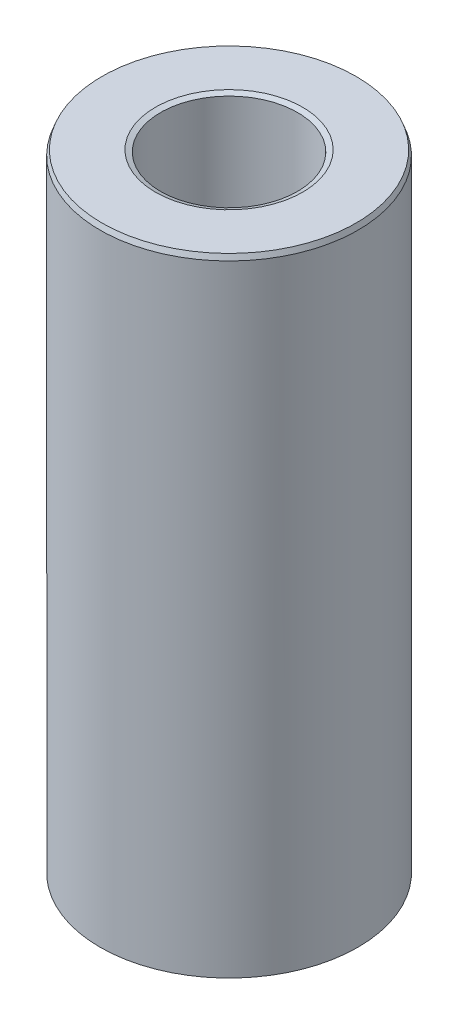
ISO-10303-21;
HEADER;
FILE_DESCRIPTION(('STEP AP214'),'2;1');
FILE_NAME('part.step','',(''),(''),'','','');
FILE_SCHEMA(('AUTOMOTIVE_DESIGN { 1 0 10303 214 1 1 1 1 }'));
ENDSEC;
DATA;
#1=APPLICATION_CONTEXT('core data for automotive mechanical design processes');
#2=APPLICATION_PROTOCOL_DEFINITION('international standard','automotive_design',2000,#1);
#3=PRODUCT_CONTEXT('',#1,'mechanical');
#4=PRODUCT('Part','Part','',(#3));
#5=PRODUCT_RELATED_PRODUCT_CATEGORY('part','',(#4));
#6=PRODUCT_DEFINITION_FORMATION('','',#4);
#7=PRODUCT_DEFINITION_CONTEXT('part definition',#1,'design');
#8=PRODUCT_DEFINITION('design','',#6,#7);
#9=PRODUCT_DEFINITION_SHAPE('','',#8);
#10=(LENGTH_UNIT() NAMED_UNIT(*) SI_UNIT(.MILLI.,.METRE.));
#11=(NAMED_UNIT(*) PLANE_ANGLE_UNIT() SI_UNIT($,.RADIAN.));
#12=(NAMED_UNIT(*) SI_UNIT($,.STERADIAN.) SOLID_ANGLE_UNIT());
#13=UNCERTAINTY_MEASURE_WITH_UNIT(LENGTH_MEASURE(1.E-05),#10,'distance_accuracy_value','');
#14=(GEOMETRIC_REPRESENTATION_CONTEXT(3) GLOBAL_UNCERTAINTY_ASSIGNED_CONTEXT((#13)) GLOBAL_UNIT_ASSIGNED_CONTEXT((#10,
#11,#12)) REPRESENTATION_CONTEXT('',''));
#15=CARTESIAN_POINT('',(0.,0.,0.));
#16=DIRECTION('',(0.,0.,1.));
#17=DIRECTION('',(1.,0.,0.));
#18=AXIS2_PLACEMENT_3D('',#15,#16,#17);
#19=CARTESIAN_POINT('',(0.,219.14236102529,0.));
#20=DIRECTION('',(0.,-1.,0.));
#21=DIRECTION('',(0.,0.,-1.));
#22=AXIS2_PLACEMENT_3D('',#19,#20,#21);
#23=CYLINDRICAL_SURFACE('',#22,45.);
#24=CARTESIAN_POINT('',(0.,0.677390465664146,0.));
#25=DIRECTION('',(0.,1.,0.));
#26=DIRECTION('',(0.,0.,1.));
#27=AXIS2_PLACEMENT_3D('',#24,#25,#26);
#28=CIRCLE('',#27,45.);
#29=CARTESIAN_POINT('',(0.,0.677390465664146,45.));
#30=VERTEX_POINT('',#29);
#31=EDGE_CURVE('E10',#30,#30,#28,.T.);
#32=ORIENTED_EDGE('',*,*,#31,.T.);
#33=EDGE_LOOP('',(#32));
#34=FACE_BOUND('',#33,.T.);
#35=CARTESIAN_POINT('',(0.,217.334993987588,0.));
#36=DIRECTION('',(0.,1.,0.));
#37=DIRECTION('',(0.,0.,1.));
#38=AXIS2_PLACEMENT_3D('',#35,#36,#37);
#39=CIRCLE('',#38,45.);
#40=CARTESIAN_POINT('',(0.,217.334993987588,-45.));
#41=VERTEX_POINT('',#40);
#42=EDGE_CURVE('E50',#41,#41,#39,.F.);
#43=ORIENTED_EDGE('',*,*,#42,.T.);
#44=EDGE_LOOP('',(#43));
#45=FACE_BOUND('',#44,.T.);
#46=ADVANCED_FACE('F39',(#34,#45),#23,.T.);
#47=CARTESIAN_POINT('',(0.,219.14236102529,0.));
#48=DIRECTION('',(0.,1.,0.));
#49=DIRECTION('',(0.,0.,1.));
#50=AXIS2_PLACEMENT_3D('',#47,#48,#49);
#51=PLANE('',#50);
#52=CARTESIAN_POINT('',(0.,219.14236102529,0.));
#53=DIRECTION('',(0.,1.,0.));
#54=DIRECTION('',(0.,0.,1.));
#55=AXIS2_PLACEMENT_3D('',#52,#53,#54);
#56=CIRCLE('',#55,25.6874575464651);
#57=CARTESIAN_POINT('',(0.,219.14236102529,25.6874575464651));
#58=VERTEX_POINT('',#57);
#59=EDGE_CURVE('E58',#58,#58,#56,.F.);
#60=ORIENTED_EDGE('',*,*,#59,.T.);
#61=EDGE_LOOP('',(#60));
#62=FACE_BOUND('',#61,.T.);
#63=CARTESIAN_POINT('',(0.,219.14236102529,0.));
#64=DIRECTION('',(0.,1.,0.));
#65=DIRECTION('',(0.,0.,1.));
#66=AXIS2_PLACEMENT_3D('',#63,#64,#65);
#67=CIRCLE('',#66,44.3226095343359);
#68=CARTESIAN_POINT('',(0.,219.14236102529,-44.3226095343359));
#69=VERTEX_POINT('',#68);
#70=EDGE_CURVE('E61',#69,#69,#67,.T.);
#71=ORIENTED_EDGE('',*,*,#70,.T.);
#72=EDGE_LOOP('',(#71));
#73=FACE_BOUND('',#72,.T.);
#74=ADVANCED_FACE('F88',(#62,#73),#51,.T.);
#75=CARTESIAN_POINT('',(0.,0.,0.));
#76=DIRECTION('',(0.,1.,0.));
#77=DIRECTION('',(0.,0.,1.));
#78=AXIS2_PLACEMENT_3D('',#75,#76,#77);
#79=PLANE('',#78);
#80=CARTESIAN_POINT('',(0.,0.,0.));
#81=DIRECTION('',(0.,1.,0.));
#82=DIRECTION('',(0.,0.,1.));
#83=AXIS2_PLACEMENT_3D('',#80,#81,#82);
#84=CIRCLE('',#83,24.5574809744273);
#85=CARTESIAN_POINT('',(0.,0.,24.5574809744273));
#86=VERTEX_POINT('',#85);
#87=EDGE_CURVE('E51',#86,#86,#84,.T.);
#88=ORIENTED_EDGE('',*,*,#87,.T.);
#89=EDGE_LOOP('',(#88));
#90=FACE_BOUND('',#89,.T.);
#91=CARTESIAN_POINT('',(0.,0.,0.));
#92=DIRECTION('',(0.,1.,0.));
#93=DIRECTION('',(0.,0.,1.));
#94=AXIS2_PLACEMENT_3D('',#91,#92,#93);
#95=CIRCLE('',#94,43.192632962298);
#96=CARTESIAN_POINT('',(0.,0.,43.192632962298));
#97=VERTEX_POINT('',#96);
#98=EDGE_CURVE('E54',#97,#97,#95,.F.);
#99=ORIENTED_EDGE('',*,*,#98,.T.);
#100=EDGE_LOOP('',(#99));
#101=FACE_BOUND('',#100,.T.);
#102=ADVANCED_FACE('F83',(#90,#101),#79,.F.);
#103=CARTESIAN_POINT('',(0.,219.14236102529,0.));
#104=DIRECTION('',(0.,-1.,0.));
#105=DIRECTION('',(0.,0.,-1.));
#106=AXIS2_PLACEMENT_3D('',#103,#104,#105);
#107=CYLINDRICAL_SURFACE('',#106,23.8800905087632);
#108=CARTESIAN_POINT('',(0.,218.464970559626,0.));
#109=DIRECTION('',(0.,1.,0.));
#110=DIRECTION('',(0.,0.,1.));
#111=AXIS2_PLACEMENT_3D('',#108,#109,#110);
#112=CIRCLE('',#111,23.8800905087632);
#113=CARTESIAN_POINT('',(0.,218.464970559626,23.8800905087632));
#114=VERTEX_POINT('',#113);
#115=EDGE_CURVE('E67',#114,#114,#112,.T.);
#116=ORIENTED_EDGE('',*,*,#115,.T.);
#117=EDGE_LOOP('',(#116));
#118=FACE_BOUND('',#117,.T.);
#119=CARTESIAN_POINT('',(0.,1.80736703770204,0.));
#120=DIRECTION('',(0.,1.,0.));
#121=DIRECTION('',(0.,0.,1.));
#122=AXIS2_PLACEMENT_3D('',#119,#120,#121);
#123=CIRCLE('',#122,23.8800905087632);
#124=CARTESIAN_POINT('',(0.,1.80736703770204,23.8800905087632));
#125=VERTEX_POINT('',#124);
#126=EDGE_CURVE('E69',#125,#125,#123,.F.);
#127=ORIENTED_EDGE('',*,*,#126,.T.);
#128=EDGE_LOOP('',(#127));
#129=FACE_BOUND('',#128,.T.);
#130=ADVANCED_FACE('F71',(#118,#129),#107,.F.);
#131=CARTESIAN_POINT('',(0.,218.464970559626,0.));
#132=DIRECTION('',(0.,1.,0.));
#133=DIRECTION('',(0.,0.,1.));
#134=AXIS2_PLACEMENT_3D('',#131,#132,#133);
#135=CONICAL_SURFACE('',#134,23.8800905087632,1.21220620156804);
#136=ORIENTED_EDGE('',*,*,#59,.F.);
#137=EDGE_LOOP('',(#136));
#138=FACE_BOUND('',#137,.T.);
#139=ORIENTED_EDGE('',*,*,#115,.F.);
#140=EDGE_LOOP('',(#139));
#141=FACE_BOUND('',#140,.T.);
#142=ADVANCED_FACE('F77',(#138,#141),#135,.F.);
#143=CARTESIAN_POINT('',(0.,0.,0.));
#144=DIRECTION('',(0.,-1.,0.));
#145=DIRECTION('',(0.,0.,-1.));
#146=AXIS2_PLACEMENT_3D('',#143,#144,#145);
#147=CONICAL_SURFACE('',#146,24.5574809744273,0.358590125226836);
#148=ORIENTED_EDGE('',*,*,#126,.F.);
#149=EDGE_LOOP('',(#148));
#150=FACE_BOUND('',#149,.T.);
#151=ORIENTED_EDGE('',*,*,#87,.F.);
#152=EDGE_LOOP('',(#151));
#153=FACE_BOUND('',#152,.T.);
#154=ADVANCED_FACE('F73',(#150,#153),#147,.F.);
#155=CARTESIAN_POINT('',(0.,0.677390465664146,0.));
#156=DIRECTION('',(0.,1.,0.));
#157=DIRECTION('',(0.,0.,1.));
#158=AXIS2_PLACEMENT_3D('',#155,#156,#157);
#159=CONICAL_SURFACE('',#158,45.,1.21220620156805);
#160=ORIENTED_EDGE('',*,*,#98,.F.);
#161=EDGE_LOOP('',(#160));
#162=FACE_BOUND('',#161,.T.);
#163=ORIENTED_EDGE('',*,*,#31,.F.);
#164=EDGE_LOOP('',(#163));
#165=FACE_BOUND('',#164,.T.);
#166=ADVANCED_FACE('F76',(#162,#165),#159,.T.);
#167=CARTESIAN_POINT('',(0.,219.14236102529,0.));
#168=DIRECTION('',(0.,-1.,0.));
#169=DIRECTION('',(0.,0.,-1.));
#170=AXIS2_PLACEMENT_3D('',#167,#168,#169);
#171=CONICAL_SURFACE('',#170,44.3226095343359,0.358590125226841);
#172=CARTESIAN_POINT('',(0.,217.334993987588,-45.));
#173=CARTESIAN_POINT('',(0.,217.353820727564,-44.992943849316));
#174=CARTESIAN_POINT('',(0.,217.37264746754,-44.985887698632));
#175=CARTESIAN_POINT('',(0.,217.410300947492,-44.971775397264));
#176=CARTESIAN_POINT('',(0.,217.429127687468,-44.96471924658));
#177=CARTESIAN_POINT('',(0.,217.46678116742,-44.950606945212));
#178=CARTESIAN_POINT('',(0.,217.485607907396,-44.943550794528));
#179=CARTESIAN_POINT('',(0.,217.523261387349,-44.92943849316));
#180=CARTESIAN_POINT('',(0.,217.542088127325,-44.922382342476));
#181=CARTESIAN_POINT('',(0.,217.579741607277,-44.908270041108));
#182=CARTESIAN_POINT('',(0.,217.598568347253,-44.901213890424));
#183=CARTESIAN_POINT('',(0.,217.636221827205,-44.887101589056));
#184=CARTESIAN_POINT('',(0.,217.655048567181,-44.880045438372));
#185=CARTESIAN_POINT('',(0.,217.692702047133,-44.865933137004));
#186=CARTESIAN_POINT('',(0.,217.711528787109,-44.85887698632));
#187=CARTESIAN_POINT('',(0.,217.749182267061,-44.844764684952));
#188=CARTESIAN_POINT('',(0.,217.768009007037,-44.837708534268));
#189=CARTESIAN_POINT('',(0.,217.805662486989,-44.8235962329));
#190=CARTESIAN_POINT('',(0.,217.824489226966,-44.816540082216));
#191=CARTESIAN_POINT('',(0.,217.862142706918,-44.802427780848));
#192=CARTESIAN_POINT('',(0.,217.880969446894,-44.795371630164));
#193=CARTESIAN_POINT('',(0.,217.918622926846,-44.781259328796));
#194=CARTESIAN_POINT('',(0.,217.937449666822,-44.774203178112));
#195=CARTESIAN_POINT('',(0.,217.975103146774,-44.760090876744));
#196=CARTESIAN_POINT('',(0.,217.99392988675,-44.75303472606));
#197=CARTESIAN_POINT('',(0.,218.031583366702,-44.738922424692));
#198=CARTESIAN_POINT('',(0.,218.050410106678,-44.731866274008));
#199=CARTESIAN_POINT('',(0.,218.08806358663,-44.71775397264));
#200=CARTESIAN_POINT('',(0.,218.106890326607,-44.710697821956));
#201=CARTESIAN_POINT('',(0.,218.144543806559,-44.696585520588));
#202=CARTESIAN_POINT('',(0.,218.163370546535,-44.689529369904));
#203=CARTESIAN_POINT('',(0.,218.201024026487,-44.6754170685359));
#204=CARTESIAN_POINT('',(0.,218.219850766463,-44.6683609178519));
#205=CARTESIAN_POINT('',(0.,218.257504246415,-44.654248616484));
#206=CARTESIAN_POINT('',(0.,218.276330986391,-44.6471924657999));
#207=CARTESIAN_POINT('',(0.,218.313984466343,-44.633080164432));
#208=CARTESIAN_POINT('',(0.,218.332811206319,-44.6260240137479));
#209=CARTESIAN_POINT('',(0.,218.370464686271,-44.6119117123799));
#210=CARTESIAN_POINT('',(0.,218.389291426247,-44.6048555616959));
#211=CARTESIAN_POINT('',(0.,218.4269449062,-44.5907432603279));
#212=CARTESIAN_POINT('',(0.,218.445771646176,-44.5836871096439));
#213=CARTESIAN_POINT('',(0.,218.483425126128,-44.5695748082759));
#214=CARTESIAN_POINT('',(0.,218.502251866104,-44.5625186575919));
#215=CARTESIAN_POINT('',(0.,218.539905346056,-44.5484063562239));
#216=CARTESIAN_POINT('',(0.,218.558732086032,-44.5413502055399));
#217=CARTESIAN_POINT('',(0.,218.596385565984,-44.5272379041719));
#218=CARTESIAN_POINT('',(0.,218.61521230596,-44.5201817534879));
#219=CARTESIAN_POINT('',(0.,218.652865785912,-44.5060694521199));
#220=CARTESIAN_POINT('',(0.,218.671692525888,-44.4990133014359));
#221=CARTESIAN_POINT('',(0.,218.70934600584,-44.4849010000679));
#222=CARTESIAN_POINT('',(0.,218.728172745817,-44.4778448493839));
#223=CARTESIAN_POINT('',(0.,218.765826225769,-44.4637325480159));
#224=CARTESIAN_POINT('',(0.,218.784652965745,-44.4566763973319));
#225=CARTESIAN_POINT('',(0.,218.822306445697,-44.4425640959639));
#226=CARTESIAN_POINT('',(0.,218.841133185673,-44.4355079452799));
#227=CARTESIAN_POINT('',(0.,218.878786665625,-44.4213956439119));
#228=CARTESIAN_POINT('',(0.,218.897613405601,-44.4143394932279));
#229=CARTESIAN_POINT('',(0.,218.935266885553,-44.4002271918599));
#230=CARTESIAN_POINT('',(0.,218.954093625529,-44.3931710411759));
#231=CARTESIAN_POINT('',(0.,218.991747105481,-44.3790587398079));
#232=CARTESIAN_POINT('',(0.,219.010573845457,-44.3720025891239));
#233=CARTESIAN_POINT('',(0.,219.04822732541,-44.3578902877559));
#234=CARTESIAN_POINT('',(0.,219.067054065386,-44.3508341370719));
#235=CARTESIAN_POINT('',(0.,219.104707545338,-44.3367218357039));
#236=CARTESIAN_POINT('',(0.,219.123534285314,-44.3296656850199));
#237=CARTESIAN_POINT('',(0.,219.14236102529,-44.3226095343359));
#238=B_SPLINE_CURVE_WITH_KNOTS('',3,(#172,#173,#174,#175,#176,#177,#178,#179,#180,#181,#182,
#183,#184,#185,#186,#187,#188,#189,#190,#191,#192,#193,#194,#195,#196,#197,#198,#199,#200,#201,
#202,#203,#204,#205,#206,#207,#208,#209,#210,#211,#212,#213,#214,#215,#216,#217,#218,#219,#220,
#221,#222,#223,#224,#225,#226,#227,#228,#229,#230,#231,#232,#233,#234,#235,#236,#237),
.UNSPECIFIED.,.F.,.F.,(4,2,2,2,2,2,2,2,2,2,2,2,2,2,2,2,2,2,2,2,2,2,2,2,2,2,2,2,2,2,2,2,4),(0.,
0.0603168185949324,0.120633637189867,0.1809504557848,0.241267274379732,0.301584092974665,
0.361900911569599,0.422217730164532,0.482534548759464,0.542851367354397,0.603168185949329,
0.663485004544264,0.723801823139196,0.784118641734129,0.844435460329061,0.904752278923996,
0.965069097518955,1.02538591611389,1.08570273470882,1.14601955330375,1.20633637189869,
1.26665319049362,1.32697000908855,1.38728682768348,1.44760364627842,1.50792046487335,
1.56823728346828,1.62855410206322,1.68887092065815,1.74918773925308,1.80950455784802,
1.86982137644295,1.93013819503791),.UNSPECIFIED.);
#239=EDGE_CURVE('BSEAM45',#41,#69,#238,.T.);
#240=ORIENTED_EDGE('',*,*,#42,.F.);
#241=ORIENTED_EDGE('',*,*,#70,.F.);
#242=ORIENTED_EDGE('',*,*,#239,.T.);
#243=ORIENTED_EDGE('',*,*,#239,.F.);
#244=EDGE_LOOP('',(#240,#242,#241,#243));
#245=FACE_BOUND('',#244,.T.);
#246=ADVANCED_FACE('F45',(#245),#171,.T.);
#247=CLOSED_SHELL('',(#46,#74,#102,#130,#142,#154,#166,#246));
#248=MANIFOLD_SOLID_BREP('B2',#247);
#249=ADVANCED_BREP_SHAPE_REPRESENTATION('',(#18,#248),#14);
#250=SHAPE_DEFINITION_REPRESENTATION(#9,#249);
ENDSEC;
END-ISO-10303-21;
